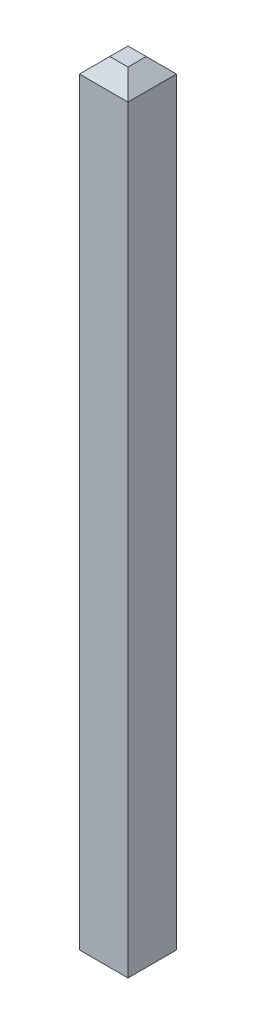
ISO-10303-21;
HEADER;
FILE_DESCRIPTION(('STEP AP214'),'2;1');
FILE_NAME('part.step','',(''),(''),'','','');
FILE_SCHEMA(('AUTOMOTIVE_DESIGN { 1 0 10303 214 1 1 1 1 }'));
ENDSEC;
DATA;
#1=APPLICATION_CONTEXT('core data for automotive mechanical design processes');
#2=APPLICATION_PROTOCOL_DEFINITION('international standard','automotive_design',2000,#1);
#3=PRODUCT_CONTEXT('',#1,'mechanical');
#4=PRODUCT('Part','Part','',(#3));
#5=PRODUCT_RELATED_PRODUCT_CATEGORY('part','',(#4));
#6=PRODUCT_DEFINITION_FORMATION('','',#4);
#7=PRODUCT_DEFINITION_CONTEXT('part definition',#1,'design');
#8=PRODUCT_DEFINITION('design','',#6,#7);
#9=PRODUCT_DEFINITION_SHAPE('','',#8);
#10=(LENGTH_UNIT() NAMED_UNIT(*) SI_UNIT(.MILLI.,.METRE.));
#11=(NAMED_UNIT(*) PLANE_ANGLE_UNIT() SI_UNIT($,.RADIAN.));
#12=(NAMED_UNIT(*) SI_UNIT($,.STERADIAN.) SOLID_ANGLE_UNIT());
#13=UNCERTAINTY_MEASURE_WITH_UNIT(LENGTH_MEASURE(1.E-05),#10,'distance_accuracy_value','');
#14=(GEOMETRIC_REPRESENTATION_CONTEXT(3) GLOBAL_UNCERTAINTY_ASSIGNED_CONTEXT((#13)) GLOBAL_UNIT_ASSIGNED_CONTEXT((#10,
#11,#12)) REPRESENTATION_CONTEXT('',''));
#15=CARTESIAN_POINT('',(0.,0.,0.));
#16=DIRECTION('',(0.,0.,1.));
#17=DIRECTION('',(1.,0.,0.));
#18=AXIS2_PLACEMENT_3D('',#15,#16,#17);
#19=CARTESIAN_POINT('',(0.,10.4,0.12));
#20=DIRECTION('',(0.,-0.707106781186544,-0.707106781186551));
#21=DIRECTION('',(0.,-0.707106781186551,0.707106781186544));
#22=AXIS2_PLACEMENT_3D('',#19,#20,#21);
#23=PLANE('',#22);
#24=DIRECTION('',(-0.577350269189624,-0.577350269189629,0.577350269189624));
#25=VECTOR('',#24,1.);
#26=CARTESIAN_POINT('',(-0.08,10.44,0.08));
#27=LINE('',#26,#25);
#28=CARTESIAN_POINT('',(-0.12,10.4,0.12));
#29=VERTEX_POINT('',#28);
#30=CARTESIAN_POINT('',(-0.32,10.2,0.32));
#31=VERTEX_POINT('',#30);
#32=EDGE_CURVE('E27',#29,#31,#27,.T.);
#33=ORIENTED_EDGE('',*,*,#32,.T.);
#34=DIRECTION('',(-1.,0.,0.));
#35=VECTOR('',#34,1.);
#36=CARTESIAN_POINT('',(-0.32,10.2,0.32));
#37=LINE('',#36,#35);
#38=CARTESIAN_POINT('',(0.32,10.2,0.32));
#39=VERTEX_POINT('',#38);
#40=EDGE_CURVE('E167',#39,#31,#37,.T.);
#41=ORIENTED_EDGE('',*,*,#40,.F.);
#42=DIRECTION('',(-0.577350269189624,0.577350269189629,-0.577350269189624));
#43=VECTOR('',#42,1.);
#44=CARTESIAN_POINT('',(0.08,10.44,0.08));
#45=LINE('',#44,#43);
#46=CARTESIAN_POINT('',(0.12,10.4,0.12));
#47=VERTEX_POINT('',#46);
#48=EDGE_CURVE('E11',#39,#47,#45,.T.);
#49=ORIENTED_EDGE('',*,*,#48,.T.);
#50=DIRECTION('',(1.,0.,0.));
#51=VECTOR('',#50,1.);
#52=CARTESIAN_POINT('',(0.,10.4,0.12));
#53=LINE('',#52,#51);
#54=EDGE_CURVE('E149',#29,#47,#53,.T.);
#55=ORIENTED_EDGE('',*,*,#54,.F.);
#56=EDGE_LOOP('',(#33,#41,#49,#55));
#57=FACE_BOUND('',#56,.T.);
#58=ADVANCED_FACE('F16',(#57),#23,.F.);
#59=CARTESIAN_POINT('',(0.12,10.4,0.));
#60=DIRECTION('',(-0.707106781186551,-0.707106781186544,0.));
#61=DIRECTION('',(-0.707106781186544,0.707106781186551,0.));
#62=AXIS2_PLACEMENT_3D('',#59,#60,#61);
#63=PLANE('',#62);
#64=DIRECTION('',(-0.577350269189624,0.577350269189629,0.577350269189624));
#65=VECTOR('',#64,1.);
#66=CARTESIAN_POINT('',(0.08,10.44,-0.08));
#67=LINE('',#66,#65);
#68=CARTESIAN_POINT('',(0.32,10.2,-0.32));
#69=VERTEX_POINT('',#68);
#70=CARTESIAN_POINT('',(0.12,10.4,-0.12));
#71=VERTEX_POINT('',#70);
#72=EDGE_CURVE('E123',#69,#71,#67,.T.);
#73=ORIENTED_EDGE('',*,*,#72,.T.);
#74=DIRECTION('',(0.,0.,-1.));
#75=VECTOR('',#74,1.);
#76=CARTESIAN_POINT('',(0.12,10.4,0.));
#77=LINE('',#76,#75);
#78=EDGE_CURVE('E143',#47,#71,#77,.T.);
#79=ORIENTED_EDGE('',*,*,#78,.F.);
#80=ORIENTED_EDGE('',*,*,#48,.F.);
#81=DIRECTION('',(0.,0.,1.));
#82=VECTOR('',#81,1.);
#83=CARTESIAN_POINT('',(0.32,10.2,0.32));
#84=LINE('',#83,#82);
#85=EDGE_CURVE('E189',#69,#39,#84,.T.);
#86=ORIENTED_EDGE('',*,*,#85,.F.);
#87=EDGE_LOOP('',(#73,#79,#80,#86));
#88=FACE_BOUND('',#87,.T.);
#89=ADVANCED_FACE('F235',(#88),#63,.F.);
#90=CARTESIAN_POINT('',(-0.12,10.4,0.));
#91=DIRECTION('',(0.707106781186551,-0.707106781186544,0.));
#92=DIRECTION('',(0.,0.,-1.));
#93=AXIS2_PLACEMENT_3D('',#90,#91,#92);
#94=PLANE('',#93);
#95=DIRECTION('',(-0.577350269189624,-0.577350269189629,-0.577350269189624));
#96=VECTOR('',#95,1.);
#97=CARTESIAN_POINT('',(-0.08,10.44,-0.08));
#98=LINE('',#97,#96);
#99=CARTESIAN_POINT('',(-0.12,10.4,-0.12));
#100=VERTEX_POINT('',#99);
#101=CARTESIAN_POINT('',(-0.32,10.2,-0.32));
#102=VERTEX_POINT('',#101);
#103=EDGE_CURVE('E104',#100,#102,#98,.T.);
#104=ORIENTED_EDGE('',*,*,#103,.T.);
#105=DIRECTION('',(0.,0.,-1.));
#106=VECTOR('',#105,1.);
#107=CARTESIAN_POINT('',(-0.32,10.2,0.32));
#108=LINE('',#107,#106);
#109=EDGE_CURVE('E168',#31,#102,#108,.T.);
#110=ORIENTED_EDGE('',*,*,#109,.F.);
#111=ORIENTED_EDGE('',*,*,#32,.F.);
#112=DIRECTION('',(0.,0.,1.));
#113=VECTOR('',#112,1.);
#114=CARTESIAN_POINT('',(-0.12,10.4,0.));
#115=LINE('',#114,#113);
#116=EDGE_CURVE('E147',#100,#29,#115,.T.);
#117=ORIENTED_EDGE('',*,*,#116,.F.);
#118=EDGE_LOOP('',(#104,#110,#111,#117));
#119=FACE_BOUND('',#118,.T.);
#120=ADVANCED_FACE('F229',(#119),#94,.F.);
#121=CARTESIAN_POINT('',(0.,10.4,-0.12));
#122=DIRECTION('',(0.,-0.707106781186544,0.707106781186551));
#123=DIRECTION('',(-1.,0.,0.));
#124=AXIS2_PLACEMENT_3D('',#121,#122,#123);
#125=PLANE('',#124);
#126=ORIENTED_EDGE('',*,*,#72,.F.);
#127=DIRECTION('',(1.,0.,0.));
#128=VECTOR('',#127,1.);
#129=CARTESIAN_POINT('',(-0.32,10.2,-0.32));
#130=LINE('',#129,#128);
#131=EDGE_CURVE('E20',#102,#69,#130,.T.);
#132=ORIENTED_EDGE('',*,*,#131,.F.);
#133=ORIENTED_EDGE('',*,*,#103,.F.);
#134=DIRECTION('',(-1.,0.,0.));
#135=VECTOR('',#134,1.);
#136=CARTESIAN_POINT('',(0.,10.4,-0.12));
#137=LINE('',#136,#135);
#138=EDGE_CURVE('E137',#71,#100,#137,.T.);
#139=ORIENTED_EDGE('',*,*,#138,.F.);
#140=EDGE_LOOP('',(#126,#132,#133,#139));
#141=FACE_BOUND('',#140,.T.);
#142=ADVANCED_FACE('F234',(#141),#125,.F.);
#143=CARTESIAN_POINT('',(-0.32,0.2,-0.32));
#144=DIRECTION('',(0.,-0.707106781186551,-0.707106781186544));
#145=DIRECTION('',(0.,0.707106781186544,-0.707106781186551));
#146=AXIS2_PLACEMENT_3D('',#143,#144,#145);
#147=PLANE('',#146);
#148=DIRECTION('',(-0.577350269189627,-0.577350269189623,0.577350269189627));
#149=VECTOR('',#148,1.);
#150=CARTESIAN_POINT('',(0.106666666666665,-0.013333333333334,-0.106666666666665));
#151=LINE('',#150,#149);
#152=CARTESIAN_POINT('',(0.32,0.2,-0.32));
#153=VERTEX_POINT('',#152);
#154=CARTESIAN_POINT('',(0.12,0.,-0.12));
#155=VERTEX_POINT('',#154);
#156=EDGE_CURVE('E124',#153,#155,#151,.T.);
#157=ORIENTED_EDGE('',*,*,#156,.T.);
#158=DIRECTION('',(1.,0.,0.));
#159=VECTOR('',#158,1.);
#160=CARTESIAN_POINT('',(0.32,0.,-0.12));
#161=LINE('',#160,#159);
#162=CARTESIAN_POINT('',(-0.12,0.,-0.12));
#163=VERTEX_POINT('',#162);
#164=EDGE_CURVE('E127',#163,#155,#161,.T.);
#165=ORIENTED_EDGE('',*,*,#164,.F.);
#166=DIRECTION('',(-0.577350269189627,0.577350269189623,-0.577350269189627));
#167=VECTOR('',#166,1.);
#168=CARTESIAN_POINT('',(-0.106666666666665,-0.013333333333334,-0.106666666666665));
#169=LINE('',#168,#167);
#170=CARTESIAN_POINT('',(-0.32,0.2,-0.32));
#171=VERTEX_POINT('',#170);
#172=EDGE_CURVE('E112',#163,#171,#169,.T.);
#173=ORIENTED_EDGE('',*,*,#172,.T.);
#174=DIRECTION('',(-1.,0.,0.));
#175=VECTOR('',#174,1.);
#176=CARTESIAN_POINT('',(-0.32,0.2,-0.32));
#177=LINE('',#176,#175);
#178=EDGE_CURVE('E181',#153,#171,#177,.T.);
#179=ORIENTED_EDGE('',*,*,#178,.F.);
#180=EDGE_LOOP('',(#157,#165,#173,#179));
#181=FACE_BOUND('',#180,.T.);
#182=ADVANCED_FACE('F18',(#181),#147,.T.);
#183=CARTESIAN_POINT('',(-0.32,0.2,0.32));
#184=DIRECTION('',(-0.707106781186544,-0.707106781186551,0.));
#185=DIRECTION('',(-0.707106781186551,0.707106781186544,0.));
#186=AXIS2_PLACEMENT_3D('',#183,#184,#185);
#187=PLANE('',#186);
#188=DIRECTION('',(-0.577350269189627,0.577350269189623,0.577350269189627));
#189=VECTOR('',#188,1.);
#190=CARTESIAN_POINT('',(-0.32,0.2,0.32));
#191=LINE('',#190,#189);
#192=CARTESIAN_POINT('',(-0.12,0.,0.12));
#193=VERTEX_POINT('',#192);
#194=CARTESIAN_POINT('',(-0.32,0.2,0.32));
#195=VERTEX_POINT('',#194);
#196=EDGE_CURVE('E86',#193,#195,#191,.T.);
#197=ORIENTED_EDGE('',*,*,#196,.T.);
#198=DIRECTION('',(0.,0.,1.));
#199=VECTOR('',#198,1.);
#200=CARTESIAN_POINT('',(-0.32,0.2,0.32));
#201=LINE('',#200,#199);
#202=EDGE_CURVE('E118',#171,#195,#201,.T.);
#203=ORIENTED_EDGE('',*,*,#202,.F.);
#204=ORIENTED_EDGE('',*,*,#172,.F.);
#205=DIRECTION('',(0.,0.,-1.));
#206=VECTOR('',#205,1.);
#207=CARTESIAN_POINT('',(-0.12,0.,-0.32));
#208=LINE('',#207,#206);
#209=EDGE_CURVE('E116',#193,#163,#208,.T.);
#210=ORIENTED_EDGE('',*,*,#209,.F.);
#211=EDGE_LOOP('',(#197,#203,#204,#210));
#212=FACE_BOUND('',#211,.T.);
#213=ADVANCED_FACE('F114',(#212),#187,.T.);
#214=CARTESIAN_POINT('',(0.32,0.2,0.32));
#215=DIRECTION('',(0.707106781186544,-0.707106781186551,0.));
#216=DIRECTION('',(0.,0.,-1.));
#217=AXIS2_PLACEMENT_3D('',#214,#215,#216);
#218=PLANE('',#217);
#219=DIRECTION('',(-0.577350269189627,-0.577350269189623,-0.577350269189627));
#220=VECTOR('',#219,1.);
#221=CARTESIAN_POINT('',(0.32,0.2,0.32));
#222=LINE('',#221,#220);
#223=CARTESIAN_POINT('',(0.32,0.2,0.32));
#224=VERTEX_POINT('',#223);
#225=CARTESIAN_POINT('',(0.12,0.,0.12));
#226=VERTEX_POINT('',#225);
#227=EDGE_CURVE('E40',#224,#226,#222,.T.);
#228=ORIENTED_EDGE('',*,*,#227,.T.);
#229=DIRECTION('',(0.,0.,1.));
#230=VECTOR('',#229,1.);
#231=CARTESIAN_POINT('',(0.12,0.,0.32));
#232=LINE('',#231,#230);
#233=EDGE_CURVE('E131',#155,#226,#232,.T.);
#234=ORIENTED_EDGE('',*,*,#233,.F.);
#235=ORIENTED_EDGE('',*,*,#156,.F.);
#236=DIRECTION('',(0.,0.,-1.));
#237=VECTOR('',#236,1.);
#238=CARTESIAN_POINT('',(0.32,0.2,-0.32));
#239=LINE('',#238,#237);
#240=EDGE_CURVE('E154',#224,#153,#239,.T.);
#241=ORIENTED_EDGE('',*,*,#240,.F.);
#242=EDGE_LOOP('',(#228,#234,#235,#241));
#243=FACE_BOUND('',#242,.T.);
#244=ADVANCED_FACE('F257',(#243),#218,.T.);
#245=CARTESIAN_POINT('',(-0.32,0.2,0.32));
#246=DIRECTION('',(0.,-0.707106781186551,0.707106781186544));
#247=DIRECTION('',(-1.,0.,0.));
#248=AXIS2_PLACEMENT_3D('',#245,#246,#247);
#249=PLANE('',#248);
#250=ORIENTED_EDGE('',*,*,#196,.F.);
#251=DIRECTION('',(-1.,0.,0.));
#252=VECTOR('',#251,1.);
#253=CARTESIAN_POINT('',(-0.32,0.,0.12));
#254=LINE('',#253,#252);
#255=EDGE_CURVE('E135',#226,#193,#254,.T.);
#256=ORIENTED_EDGE('',*,*,#255,.F.);
#257=ORIENTED_EDGE('',*,*,#227,.F.);
#258=DIRECTION('',(1.,0.,0.));
#259=VECTOR('',#258,1.);
#260=CARTESIAN_POINT('',(0.32,0.2,0.32));
#261=LINE('',#260,#259);
#262=EDGE_CURVE('E163',#195,#224,#261,.T.);
#263=ORIENTED_EDGE('',*,*,#262,.F.);
#264=EDGE_LOOP('',(#250,#256,#257,#263));
#265=FACE_BOUND('',#264,.T.);
#266=ADVANCED_FACE('F221',(#265),#249,.T.);
#267=CARTESIAN_POINT('',(0.,0.,0.));
#268=DIRECTION('',(0.,-1.,0.));
#269=DIRECTION('',(0.,0.,-1.));
#270=AXIS2_PLACEMENT_3D('',#267,#268,#269);
#271=PLANE('',#270);
#272=ORIENTED_EDGE('',*,*,#209,.T.);
#273=ORIENTED_EDGE('',*,*,#164,.T.);
#274=ORIENTED_EDGE('',*,*,#233,.T.);
#275=ORIENTED_EDGE('',*,*,#255,.T.);
#276=EDGE_LOOP('',(#272,#273,#274,#275));
#277=FACE_BOUND('',#276,.T.);
#278=ADVANCED_FACE('F134',(#277),#271,.T.);
#279=CARTESIAN_POINT('',(0.,10.4,0.));
#280=DIRECTION('',(0.,-1.,0.));
#281=DIRECTION('',(0.,0.,-1.));
#282=AXIS2_PLACEMENT_3D('',#279,#280,#281);
#283=PLANE('',#282);
#284=ORIENTED_EDGE('',*,*,#116,.T.);
#285=ORIENTED_EDGE('',*,*,#54,.T.);
#286=ORIENTED_EDGE('',*,*,#78,.T.);
#287=ORIENTED_EDGE('',*,*,#138,.T.);
#288=EDGE_LOOP('',(#284,#285,#286,#287));
#289=FACE_BOUND('',#288,.T.);
#290=ADVANCED_FACE('F220',(#289),#283,.F.);
#291=CARTESIAN_POINT('',(-0.32,10.4,0.32));
#292=DIRECTION('',(0.,0.,-1.));
#293=DIRECTION('',(0.,-1.,0.));
#294=AXIS2_PLACEMENT_3D('',#291,#292,#293);
#295=PLANE('',#294);
#296=DIRECTION('',(0.,-1.,0.));
#297=VECTOR('',#296,1.);
#298=CARTESIAN_POINT('',(-0.32,10.4,0.32));
#299=LINE('',#298,#297);
#300=EDGE_CURVE('E162',#31,#195,#299,.T.);
#301=ORIENTED_EDGE('',*,*,#300,.T.);
#302=ORIENTED_EDGE('',*,*,#262,.T.);
#303=DIRECTION('',(0.,-1.,0.));
#304=VECTOR('',#303,1.);
#305=CARTESIAN_POINT('',(0.32,10.4,0.32));
#306=LINE('',#305,#304);
#307=EDGE_CURVE('E159',#39,#224,#306,.T.);
#308=ORIENTED_EDGE('',*,*,#307,.F.);
#309=ORIENTED_EDGE('',*,*,#40,.T.);
#310=EDGE_LOOP('',(#301,#302,#308,#309));
#311=FACE_BOUND('',#310,.T.);
#312=ADVANCED_FACE('F249',(#311),#295,.F.);
#313=CARTESIAN_POINT('',(-0.32,10.4,0.32));
#314=DIRECTION('',(1.,0.,0.));
#315=DIRECTION('',(0.,1.,0.));
#316=AXIS2_PLACEMENT_3D('',#313,#314,#315);
#317=PLANE('',#316);
#318=DIRECTION('',(0.,-1.,0.));
#319=VECTOR('',#318,1.);
#320=CARTESIAN_POINT('',(-0.32,10.4,-0.32));
#321=LINE('',#320,#319);
#322=EDGE_CURVE('E178',#102,#171,#321,.T.);
#323=ORIENTED_EDGE('',*,*,#322,.T.);
#324=ORIENTED_EDGE('',*,*,#202,.T.);
#325=ORIENTED_EDGE('',*,*,#300,.F.);
#326=ORIENTED_EDGE('',*,*,#109,.T.);
#327=EDGE_LOOP('',(#323,#324,#325,#326));
#328=FACE_BOUND('',#327,.T.);
#329=ADVANCED_FACE('F243',(#328),#317,.F.);
#330=CARTESIAN_POINT('',(-0.32,10.4,-0.32));
#331=DIRECTION('',(0.,0.,1.));
#332=DIRECTION('',(1.,0.,0.));
#333=AXIS2_PLACEMENT_3D('',#330,#331,#332);
#334=PLANE('',#333);
#335=DIRECTION('',(0.,-1.,0.));
#336=VECTOR('',#335,1.);
#337=CARTESIAN_POINT('',(0.32,10.4,-0.32));
#338=LINE('',#337,#336);
#339=EDGE_CURVE('E158',#69,#153,#338,.T.);
#340=ORIENTED_EDGE('',*,*,#339,.T.);
#341=ORIENTED_EDGE('',*,*,#178,.T.);
#342=ORIENTED_EDGE('',*,*,#322,.F.);
#343=ORIENTED_EDGE('',*,*,#131,.T.);
#344=EDGE_LOOP('',(#340,#341,#342,#343));
#345=FACE_BOUND('',#344,.T.);
#346=ADVANCED_FACE('F248',(#345),#334,.F.);
#347=CARTESIAN_POINT('',(0.32,10.4,0.32));
#348=DIRECTION('',(-1.,0.,0.));
#349=DIRECTION('',(0.,0.,1.));
#350=AXIS2_PLACEMENT_3D('',#347,#348,#349);
#351=PLANE('',#350);
#352=ORIENTED_EDGE('',*,*,#307,.T.);
#353=ORIENTED_EDGE('',*,*,#240,.T.);
#354=ORIENTED_EDGE('',*,*,#339,.F.);
#355=ORIENTED_EDGE('',*,*,#85,.T.);
#356=EDGE_LOOP('',(#352,#353,#354,#355));
#357=FACE_BOUND('',#356,.T.);
#358=ADVANCED_FACE('F286',(#357),#351,.F.);
#359=CLOSED_SHELL('',(#58,#89,#120,#142,#182,#213,#244,#266,#278,#290,#312,#329,#346,#358));
#360=MANIFOLD_SOLID_BREP('B1',#359);
#361=ADVANCED_BREP_SHAPE_REPRESENTATION('',(#18,#360),#14);
#362=SHAPE_DEFINITION_REPRESENTATION(#9,#361);
ENDSEC;
END-ISO-10303-21;
